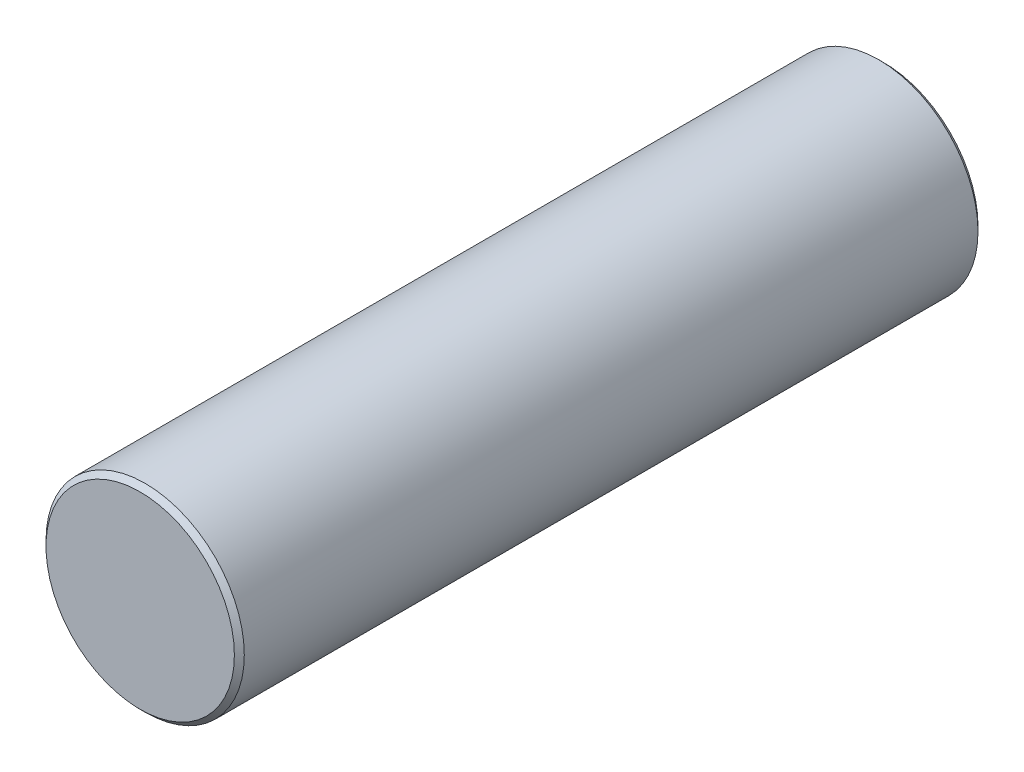
ISO-10303-21;
HEADER;
FILE_DESCRIPTION(('STEP AP214'),'2;1');
FILE_NAME('part.step','',(''),(''),'','','');
FILE_SCHEMA(('AUTOMOTIVE_DESIGN { 1 0 10303 214 1 1 1 1 }'));
ENDSEC;
DATA;
#1=APPLICATION_CONTEXT('core data for automotive mechanical design processes');
#2=APPLICATION_PROTOCOL_DEFINITION('international standard','automotive_design',2000,#1);
#3=PRODUCT_CONTEXT('',#1,'mechanical');
#4=PRODUCT('Part','Part','',(#3));
#5=PRODUCT_RELATED_PRODUCT_CATEGORY('part','',(#4));
#6=PRODUCT_DEFINITION_FORMATION('','',#4);
#7=PRODUCT_DEFINITION_CONTEXT('part definition',#1,'design');
#8=PRODUCT_DEFINITION('design','',#6,#7);
#9=PRODUCT_DEFINITION_SHAPE('','',#8);
#10=(LENGTH_UNIT() NAMED_UNIT(*) SI_UNIT(.MILLI.,.METRE.));
#11=(NAMED_UNIT(*) PLANE_ANGLE_UNIT() SI_UNIT($,.RADIAN.));
#12=(NAMED_UNIT(*) SI_UNIT($,.STERADIAN.) SOLID_ANGLE_UNIT());
#13=UNCERTAINTY_MEASURE_WITH_UNIT(LENGTH_MEASURE(1.E-05),#10,'distance_accuracy_value','');
#14=(GEOMETRIC_REPRESENTATION_CONTEXT(3) GLOBAL_UNCERTAINTY_ASSIGNED_CONTEXT((#13)) GLOBAL_UNIT_ASSIGNED_CONTEXT((#10,
#11,#12)) REPRESENTATION_CONTEXT('',''));
#15=CARTESIAN_POINT('',(0.,0.,0.));
#16=DIRECTION('',(0.,0.,1.));
#17=DIRECTION('',(1.,0.,0.));
#18=AXIS2_PLACEMENT_3D('',#15,#16,#17);
#19=CARTESIAN_POINT('',(0.,0.,150.));
#20=DIRECTION('',(0.,0.,-1.));
#21=DIRECTION('',(-1.,0.,0.));
#22=AXIS2_PLACEMENT_3D('',#19,#20,#21);
#23=CYLINDRICAL_SURFACE('',#22,20.);
#24=CARTESIAN_POINT('',(0.,0.,0.999999999999973));
#25=DIRECTION('',(0.,0.,1.));
#26=DIRECTION('',(1.,0.,0.));
#27=AXIS2_PLACEMENT_3D('',#24,#25,#26);
#28=CIRCLE('',#27,20.);
#29=CARTESIAN_POINT('',(20.,0.,0.999999999999973));
#30=VERTEX_POINT('',#29);
#31=EDGE_CURVE('E52',#30,#30,#28,.T.);
#32=ORIENTED_EDGE('',*,*,#31,.T.);
#33=EDGE_LOOP('',(#32));
#34=FACE_BOUND('',#33,.T.);
#35=CARTESIAN_POINT('',(0.,0.,149.));
#36=DIRECTION('',(0.,0.,1.));
#37=DIRECTION('',(1.,0.,0.));
#38=AXIS2_PLACEMENT_3D('',#35,#36,#37);
#39=CIRCLE('',#38,20.);
#40=CARTESIAN_POINT('',(20.,0.,149.));
#41=VERTEX_POINT('',#40);
#42=EDGE_CURVE('E57',#41,#41,#39,.F.);
#43=ORIENTED_EDGE('',*,*,#42,.T.);
#44=EDGE_LOOP('',(#43));
#45=FACE_BOUND('',#44,.T.);
#46=ADVANCED_FACE('F39',(#34,#45),#23,.T.);
#47=CARTESIAN_POINT('',(0.,0.,150.));
#48=DIRECTION('',(0.,0.,1.));
#49=DIRECTION('',(1.,0.,0.));
#50=AXIS2_PLACEMENT_3D('',#47,#48,#49);
#51=PLANE('',#50);
#52=CARTESIAN_POINT('',(0.,0.,150.));
#53=DIRECTION('',(0.,0.,1.));
#54=DIRECTION('',(1.,0.,0.));
#55=AXIS2_PLACEMENT_3D('',#52,#53,#54);
#56=CIRCLE('',#55,19.);
#57=CARTESIAN_POINT('',(19.,0.,150.));
#58=VERTEX_POINT('',#57);
#59=EDGE_CURVE('E10',#58,#58,#56,.T.);
#60=ORIENTED_EDGE('',*,*,#59,.T.);
#61=EDGE_LOOP('',(#60));
#62=FACE_BOUND('',#61,.T.);
#63=ADVANCED_FACE('F74',(#62),#51,.T.);
#64=CARTESIAN_POINT('',(0.,0.,0.));
#65=DIRECTION('',(0.,0.,1.));
#66=DIRECTION('',(1.,0.,0.));
#67=AXIS2_PLACEMENT_3D('',#64,#65,#66);
#68=PLANE('',#67);
#69=CARTESIAN_POINT('',(0.,0.,0.));
#70=DIRECTION('',(0.,0.,1.));
#71=DIRECTION('',(1.,0.,0.));
#72=AXIS2_PLACEMENT_3D('',#69,#70,#71);
#73=CIRCLE('',#72,19.);
#74=CARTESIAN_POINT('',(19.,0.,0.));
#75=VERTEX_POINT('',#74);
#76=EDGE_CURVE('E47',#75,#75,#73,.F.);
#77=ORIENTED_EDGE('',*,*,#76,.T.);
#78=EDGE_LOOP('',(#77));
#79=FACE_BOUND('',#78,.T.);
#80=ADVANCED_FACE('F71',(#79),#68,.F.);
#81=CARTESIAN_POINT('',(0.,0.,0.999999999999973));
#82=DIRECTION('',(0.,0.,1.));
#83=DIRECTION('',(1.,0.,0.));
#84=AXIS2_PLACEMENT_3D('',#81,#82,#83);
#85=CONICAL_SURFACE('',#84,20.,0.785398163397448);
#86=ORIENTED_EDGE('',*,*,#76,.F.);
#87=EDGE_LOOP('',(#86));
#88=FACE_BOUND('',#87,.T.);
#89=ORIENTED_EDGE('',*,*,#31,.F.);
#90=EDGE_LOOP('',(#89));
#91=FACE_BOUND('',#90,.T.);
#92=ADVANCED_FACE('F67',(#88,#91),#85,.T.);
#93=CARTESIAN_POINT('',(0.,0.,150.));
#94=DIRECTION('',(0.,0.,-1.));
#95=DIRECTION('',(-1.,0.,0.));
#96=AXIS2_PLACEMENT_3D('',#93,#94,#95);
#97=CONICAL_SURFACE('',#96,19.,0.785398163397435);
#98=ORIENTED_EDGE('',*,*,#42,.F.);
#99=EDGE_LOOP('',(#98));
#100=FACE_BOUND('',#99,.T.);
#101=ORIENTED_EDGE('',*,*,#59,.F.);
#102=EDGE_LOOP('',(#101));
#103=FACE_BOUND('',#102,.T.);
#104=ADVANCED_FACE('F41',(#100,#103),#97,.T.);
#105=CLOSED_SHELL('',(#46,#63,#80,#92,#104));
#106=MANIFOLD_SOLID_BREP('B2',#105);
#107=ADVANCED_BREP_SHAPE_REPRESENTATION('',(#18,#106),#14);
#108=SHAPE_DEFINITION_REPRESENTATION(#9,#107);
ENDSEC;
END-ISO-10303-21;
